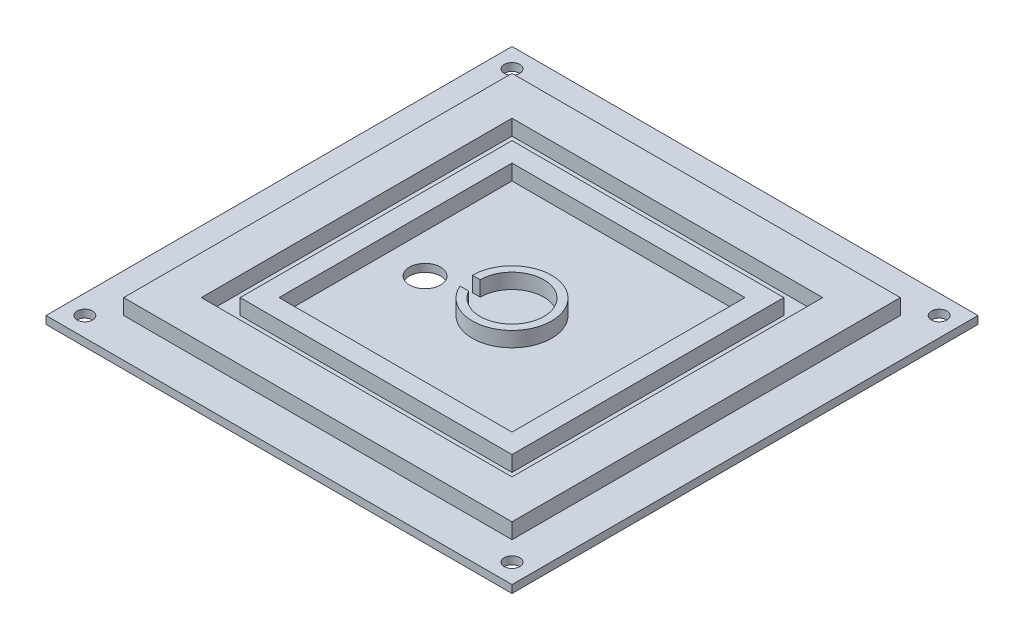
ISO-10303-21;
HEADER;
FILE_DESCRIPTION(('STEP AP214'),'2;1');
FILE_NAME('part.step','',(''),(''),'','','');
FILE_SCHEMA(('AUTOMOTIVE_DESIGN { 1 0 10303 214 1 1 1 1 }'));
ENDSEC;
DATA;
#1=APPLICATION_CONTEXT('core data for automotive mechanical design processes');
#2=APPLICATION_PROTOCOL_DEFINITION('international standard','automotive_design',2000,#1);
#3=PRODUCT_CONTEXT('',#1,'mechanical');
#4=PRODUCT('Part','Part','',(#3));
#5=PRODUCT_RELATED_PRODUCT_CATEGORY('part','',(#4));
#6=PRODUCT_DEFINITION_FORMATION('','',#4);
#7=PRODUCT_DEFINITION_CONTEXT('part definition',#1,'design');
#8=PRODUCT_DEFINITION('design','',#6,#7);
#9=PRODUCT_DEFINITION_SHAPE('','',#8);
#10=(LENGTH_UNIT() NAMED_UNIT(*) SI_UNIT(.MILLI.,.METRE.));
#11=(NAMED_UNIT(*) PLANE_ANGLE_UNIT() SI_UNIT($,.RADIAN.));
#12=(NAMED_UNIT(*) SI_UNIT($,.STERADIAN.) SOLID_ANGLE_UNIT());
#13=UNCERTAINTY_MEASURE_WITH_UNIT(LENGTH_MEASURE(1.E-05),#10,'distance_accuracy_value','');
#14=(GEOMETRIC_REPRESENTATION_CONTEXT(3) GLOBAL_UNCERTAINTY_ASSIGNED_CONTEXT((#13)) GLOBAL_UNIT_ASSIGNED_CONTEXT((#10,
#11,#12)) REPRESENTATION_CONTEXT('',''));
#15=CARTESIAN_POINT('',(0.,0.,0.));
#16=DIRECTION('',(0.,0.,1.));
#17=DIRECTION('',(1.,0.,0.));
#18=AXIS2_PLACEMENT_3D('',#15,#16,#17);
#19=CARTESIAN_POINT('',(0.,0.,0.));
#20=DIRECTION('',(0.,1.,0.));
#21=DIRECTION('',(0.,0.,1.));
#22=AXIS2_PLACEMENT_3D('',#19,#20,#21);
#23=PLANE('',#22);
#24=CARTESIAN_POINT('',(-25.4,0.,3.048));
#25=DIRECTION('',(0.,1.,0.));
#26=DIRECTION('',(0.,0.,1.));
#27=AXIS2_PLACEMENT_3D('',#24,#25,#26);
#28=CIRCLE('',#27,5.08);
#29=CARTESIAN_POINT('',(-25.4,0.,8.128));
#30=VERTEX_POINT('',#29);
#31=EDGE_CURVE('E247',#30,#30,#28,.T.);
#32=ORIENTED_EDGE('',*,*,#31,.F.);
#33=EDGE_LOOP('',(#32));
#34=FACE_BOUND('',#33,.T.);
#35=DIRECTION('',(0.,0.,-1.));
#36=VECTOR('',#35,1.);
#37=CARTESIAN_POINT('',(38.1,0.,-38.1));
#38=LINE('',#37,#36);
#39=CARTESIAN_POINT('',(38.1,0.,38.1));
#40=VERTEX_POINT('',#39);
#41=CARTESIAN_POINT('',(38.1,0.,-38.1));
#42=VERTEX_POINT('',#41);
#43=EDGE_CURVE('E266',#40,#42,#38,.T.);
#44=ORIENTED_EDGE('',*,*,#43,.T.);
#45=DIRECTION('',(-1.,0.,0.));
#46=VECTOR('',#45,1.);
#47=CARTESIAN_POINT('',(-38.1,0.,-38.1));
#48=LINE('',#47,#46);
#49=CARTESIAN_POINT('',(-38.1,0.,-38.1));
#50=VERTEX_POINT('',#49);
#51=EDGE_CURVE('E269',#42,#50,#48,.T.);
#52=ORIENTED_EDGE('',*,*,#51,.T.);
#53=DIRECTION('',(0.,0.,1.));
#54=VECTOR('',#53,1.);
#55=CARTESIAN_POINT('',(-38.1,0.,-38.1));
#56=LINE('',#55,#54);
#57=CARTESIAN_POINT('',(-38.1,0.,38.1));
#58=VERTEX_POINT('',#57);
#59=EDGE_CURVE('E273',#50,#58,#56,.T.);
#60=ORIENTED_EDGE('',*,*,#59,.T.);
#61=DIRECTION('',(1.,0.,0.));
#62=VECTOR('',#61,1.);
#63=CARTESIAN_POINT('',(-38.1,0.,38.1));
#64=LINE('',#63,#62);
#65=EDGE_CURVE('E276',#58,#40,#64,.T.);
#66=ORIENTED_EDGE('',*,*,#65,.T.);
#67=EDGE_LOOP('',(#44,#52,#60,#66));
#68=FACE_BOUND('',#67,.T.);
#69=DIRECTION('',(1.,0.,0.));
#70=VECTOR('',#69,1.);
#71=CARTESIAN_POINT('',(-10.414,0.,0.));
#72=LINE('',#71,#70);
#73=CARTESIAN_POINT('',(-12.954,0.,0.));
#74=VERTEX_POINT('',#73);
#75=CARTESIAN_POINT('',(-10.414,0.,0.));
#76=VERTEX_POINT('',#75);
#77=EDGE_CURVE('E256',#74,#76,#72,.T.);
#78=ORIENTED_EDGE('',*,*,#77,.F.);
#79=CARTESIAN_POINT('',(0.,0.,0.));
#80=DIRECTION('',(0.,1.,0.));
#81=DIRECTION('',(0.,0.,1.));
#82=AXIS2_PLACEMENT_3D('',#79,#80,#81);
#83=CIRCLE('',#82,12.954);
#84=CARTESIAN_POINT('',(-11.9163633714317,0.,5.07999999999999));
#85=VERTEX_POINT('',#84);
#86=EDGE_CURVE('E204',#85,#74,#83,.T.);
#87=ORIENTED_EDGE('',*,*,#86,.F.);
#88=DIRECTION('',(-1.,0.,0.));
#89=VECTOR('',#88,1.);
#90=CARTESIAN_POINT('',(-9.09092932543203,0.,5.07999999999999));
#91=LINE('',#90,#89);
#92=CARTESIAN_POINT('',(-9.09092932543203,0.,5.07999999999999));
#93=VERTEX_POINT('',#92);
#94=EDGE_CURVE('E260',#93,#85,#91,.T.);
#95=ORIENTED_EDGE('',*,*,#94,.F.);
#96=CARTESIAN_POINT('',(0.,0.,0.));
#97=DIRECTION('',(0.,-1.,0.));
#98=DIRECTION('',(0.,0.,1.));
#99=AXIS2_PLACEMENT_3D('',#96,#97,#98);
#100=CIRCLE('',#99,10.414);
#101=EDGE_CURVE('E258',#76,#93,#100,.T.);
#102=ORIENTED_EDGE('',*,*,#101,.F.);
#103=EDGE_LOOP('',(#78,#87,#95,#102));
#104=FACE_BOUND('',#103,.T.);
#105=ADVANCED_FACE('F35',(#34,#68,#104),#23,.T.);
#106=CARTESIAN_POINT('',(0.,0.,0.));
#107=DIRECTION('',(0.,1.,0.));
#108=DIRECTION('',(0.,0.,1.));
#109=AXIS2_PLACEMENT_3D('',#106,#107,#108);
#110=PLANE('',#109);
#111=DIRECTION('',(0.,0.,-1.));
#112=VECTOR('',#111,1.);
#113=CARTESIAN_POINT('',(50.8,0.,-50.8));
#114=LINE('',#113,#112);
#115=CARTESIAN_POINT('',(50.8,0.,50.8));
#116=VERTEX_POINT('',#115);
#117=CARTESIAN_POINT('',(50.8,0.,-50.8));
#118=VERTEX_POINT('',#117);
#119=EDGE_CURVE('E326',#116,#118,#114,.T.);
#120=ORIENTED_EDGE('',*,*,#119,.T.);
#121=DIRECTION('',(-1.,0.,0.));
#122=VECTOR('',#121,1.);
#123=CARTESIAN_POINT('',(-50.8,0.,-50.8));
#124=LINE('',#123,#122);
#125=CARTESIAN_POINT('',(-50.8,0.,-50.8));
#126=VERTEX_POINT('',#125);
#127=EDGE_CURVE('E329',#118,#126,#124,.T.);
#128=ORIENTED_EDGE('',*,*,#127,.T.);
#129=DIRECTION('',(0.,0.,1.));
#130=VECTOR('',#129,1.);
#131=CARTESIAN_POINT('',(-50.8,0.,-50.8));
#132=LINE('',#131,#130);
#133=CARTESIAN_POINT('',(-50.8,0.,50.8));
#134=VERTEX_POINT('',#133);
#135=EDGE_CURVE('E333',#126,#134,#132,.T.);
#136=ORIENTED_EDGE('',*,*,#135,.T.);
#137=DIRECTION('',(1.,0.,0.));
#138=VECTOR('',#137,1.);
#139=CARTESIAN_POINT('',(-50.8,0.,50.8));
#140=LINE('',#139,#138);
#141=EDGE_CURVE('E336',#134,#116,#140,.T.);
#142=ORIENTED_EDGE('',*,*,#141,.T.);
#143=EDGE_LOOP('',(#120,#128,#136,#142));
#144=FACE_BOUND('',#143,.T.);
#145=DIRECTION('',(-1.,0.,0.));
#146=VECTOR('',#145,1.);
#147=CARTESIAN_POINT('',(-44.45,0.,-44.45));
#148=LINE('',#147,#146);
#149=CARTESIAN_POINT('',(44.45,0.,-44.45));
#150=VERTEX_POINT('',#149);
#151=CARTESIAN_POINT('',(-44.45,0.,-44.45));
#152=VERTEX_POINT('',#151);
#153=EDGE_CURVE('E310',#150,#152,#148,.T.);
#154=ORIENTED_EDGE('',*,*,#153,.F.);
#155=DIRECTION('',(0.,0.,-1.));
#156=VECTOR('',#155,1.);
#157=CARTESIAN_POINT('',(44.45,0.,-44.45));
#158=LINE('',#157,#156);
#159=CARTESIAN_POINT('',(44.45,0.,44.45));
#160=VERTEX_POINT('',#159);
#161=EDGE_CURVE('E291',#160,#150,#158,.T.);
#162=ORIENTED_EDGE('',*,*,#161,.F.);
#163=DIRECTION('',(1.,0.,0.));
#164=VECTOR('',#163,1.);
#165=CARTESIAN_POINT('',(-44.45,0.,44.45));
#166=LINE('',#165,#164);
#167=CARTESIAN_POINT('',(-44.45,0.,44.45));
#168=VERTEX_POINT('',#167);
#169=EDGE_CURVE('E301',#168,#160,#166,.T.);
#170=ORIENTED_EDGE('',*,*,#169,.F.);
#171=DIRECTION('',(0.,0.,1.));
#172=VECTOR('',#171,1.);
#173=CARTESIAN_POINT('',(-44.45,0.,-44.45));
#174=LINE('',#173,#172);
#175=EDGE_CURVE('E312',#152,#168,#174,.T.);
#176=ORIENTED_EDGE('',*,*,#175,.F.);
#177=EDGE_LOOP('',(#154,#162,#170,#176));
#178=FACE_BOUND('',#177,.T.);
#179=ADVANCED_FACE('F439',(#144,#178),#110,.T.);
#180=CARTESIAN_POINT('',(76.2,-2.54,-76.2));
#181=DIRECTION('',(1.,0.,0.));
#182=DIRECTION('',(0.,0.,-1.));
#183=AXIS2_PLACEMENT_3D('',#180,#181,#182);
#184=PLANE('',#183);
#185=DIRECTION('',(0.,0.,-1.));
#186=VECTOR('',#185,1.);
#187=CARTESIAN_POINT('',(76.2,0.,-76.2));
#188=LINE('',#187,#186);
#189=CARTESIAN_POINT('',(76.2,0.,76.2));
#190=VERTEX_POINT('',#189);
#191=CARTESIAN_POINT('',(76.2,0.,-76.2));
#192=VERTEX_POINT('',#191);
#193=EDGE_CURVE('E387',#190,#192,#188,.T.);
#194=ORIENTED_EDGE('',*,*,#193,.F.);
#195=DIRECTION('',(0.,1.,0.));
#196=VECTOR('',#195,1.);
#197=CARTESIAN_POINT('',(76.2,-2.54,76.2));
#198=LINE('',#197,#196);
#199=CARTESIAN_POINT('',(76.2,-2.54,76.2));
#200=VERTEX_POINT('',#199);
#201=EDGE_CURVE('E11',#200,#190,#198,.T.);
#202=ORIENTED_EDGE('',*,*,#201,.F.);
#203=DIRECTION('',(0.,0.,-1.));
#204=VECTOR('',#203,1.);
#205=CARTESIAN_POINT('',(76.2,-2.54,-76.2));
#206=LINE('',#205,#204);
#207=CARTESIAN_POINT('',(76.2,-2.54,-76.2));
#208=VERTEX_POINT('',#207);
#209=EDGE_CURVE('E388',#200,#208,#206,.T.);
#210=ORIENTED_EDGE('',*,*,#209,.T.);
#211=DIRECTION('',(0.,1.,0.));
#212=VECTOR('',#211,1.);
#213=CARTESIAN_POINT('',(76.2,-2.54,-76.2));
#214=LINE('',#213,#212);
#215=EDGE_CURVE('E39',#208,#192,#214,.T.);
#216=ORIENTED_EDGE('',*,*,#215,.T.);
#217=EDGE_LOOP('',(#194,#202,#210,#216));
#218=FACE_BOUND('',#217,.T.);
#219=ADVANCED_FACE('F37',(#218),#184,.T.);
#220=CARTESIAN_POINT('',(-76.2,-2.54,76.2));
#221=DIRECTION('',(0.,0.,1.));
#222=DIRECTION('',(1.,0.,0.));
#223=AXIS2_PLACEMENT_3D('',#220,#221,#222);
#224=PLANE('',#223);
#225=DIRECTION('',(1.,0.,0.));
#226=VECTOR('',#225,1.);
#227=CARTESIAN_POINT('',(-76.2,0.,76.2));
#228=LINE('',#227,#226);
#229=CARTESIAN_POINT('',(-76.2,0.,76.2));
#230=VERTEX_POINT('',#229);
#231=EDGE_CURVE('E392',#230,#190,#228,.T.);
#232=ORIENTED_EDGE('',*,*,#231,.F.);
#233=DIRECTION('',(0.,1.,0.));
#234=VECTOR('',#233,1.);
#235=CARTESIAN_POINT('',(-76.2,-2.54,76.2));
#236=LINE('',#235,#234);
#237=CARTESIAN_POINT('',(-76.2,-2.54,76.2));
#238=VERTEX_POINT('',#237);
#239=EDGE_CURVE('E44',#238,#230,#236,.T.);
#240=ORIENTED_EDGE('',*,*,#239,.F.);
#241=DIRECTION('',(1.,0.,0.));
#242=VECTOR('',#241,1.);
#243=CARTESIAN_POINT('',(-76.2,-2.54,76.2));
#244=LINE('',#243,#242);
#245=EDGE_CURVE('E398',#238,#200,#244,.T.);
#246=ORIENTED_EDGE('',*,*,#245,.T.);
#247=ORIENTED_EDGE('',*,*,#201,.T.);
#248=EDGE_LOOP('',(#232,#240,#246,#247));
#249=FACE_BOUND('',#248,.T.);
#250=ADVANCED_FACE('F424',(#249),#224,.T.);
#251=CARTESIAN_POINT('',(-76.2,-2.54,-76.2));
#252=DIRECTION('',(-1.,0.,0.));
#253=DIRECTION('',(0.,0.,1.));
#254=AXIS2_PLACEMENT_3D('',#251,#252,#253);
#255=PLANE('',#254);
#256=DIRECTION('',(0.,0.,1.));
#257=VECTOR('',#256,1.);
#258=CARTESIAN_POINT('',(-76.2,0.,-76.2));
#259=LINE('',#258,#257);
#260=CARTESIAN_POINT('',(-76.2,0.,-76.2));
#261=VERTEX_POINT('',#260);
#262=EDGE_CURVE('E406',#261,#230,#259,.T.);
#263=ORIENTED_EDGE('',*,*,#262,.F.);
#264=DIRECTION('',(0.,1.,0.));
#265=VECTOR('',#264,1.);
#266=CARTESIAN_POINT('',(-76.2,-2.54,-76.2));
#267=LINE('',#266,#265);
#268=CARTESIAN_POINT('',(-76.2,-2.54,-76.2));
#269=VERTEX_POINT('',#268);
#270=EDGE_CURVE('E411',#269,#261,#267,.T.);
#271=ORIENTED_EDGE('',*,*,#270,.F.);
#272=DIRECTION('',(0.,0.,1.));
#273=VECTOR('',#272,1.);
#274=CARTESIAN_POINT('',(-76.2,-2.54,-76.2));
#275=LINE('',#274,#273);
#276=EDGE_CURVE('E395',#269,#238,#275,.T.);
#277=ORIENTED_EDGE('',*,*,#276,.T.);
#278=ORIENTED_EDGE('',*,*,#239,.T.);
#279=EDGE_LOOP('',(#263,#271,#277,#278));
#280=FACE_BOUND('',#279,.T.);
#281=ADVANCED_FACE('F430',(#280),#255,.T.);
#282=CARTESIAN_POINT('',(-76.2,-2.54,-76.2));
#283=DIRECTION('',(0.,0.,-1.));
#284=DIRECTION('',(-1.,0.,0.));
#285=AXIS2_PLACEMENT_3D('',#282,#283,#284);
#286=PLANE('',#285);
#287=DIRECTION('',(-1.,0.,0.));
#288=VECTOR('',#287,1.);
#289=CARTESIAN_POINT('',(-76.2,0.,-76.2));
#290=LINE('',#289,#288);
#291=EDGE_CURVE('E403',#192,#261,#290,.T.);
#292=ORIENTED_EDGE('',*,*,#291,.F.);
#293=ORIENTED_EDGE('',*,*,#215,.F.);
#294=DIRECTION('',(-1.,0.,0.));
#295=VECTOR('',#294,1.);
#296=CARTESIAN_POINT('',(-76.2,-2.54,-76.2));
#297=LINE('',#296,#295);
#298=EDGE_CURVE('E391',#208,#269,#297,.T.);
#299=ORIENTED_EDGE('',*,*,#298,.T.);
#300=ORIENTED_EDGE('',*,*,#270,.T.);
#301=EDGE_LOOP('',(#292,#293,#299,#300));
#302=FACE_BOUND('',#301,.T.);
#303=ADVANCED_FACE('F419',(#302),#286,.T.);
#304=CARTESIAN_POINT('',(0.,-2.54,0.));
#305=DIRECTION('',(0.,1.,0.));
#306=DIRECTION('',(0.,0.,1.));
#307=AXIS2_PLACEMENT_3D('',#304,#305,#306);
#308=PLANE('',#307);
#309=CARTESIAN_POINT('',(-69.85,-2.54,-69.85));
#310=DIRECTION('',(0.,1.,0.));
#311=DIRECTION('',(0.,0.,1.));
#312=AXIS2_PLACEMENT_3D('',#309,#310,#311);
#313=CIRCLE('',#312,2.53999999999999);
#314=CARTESIAN_POINT('',(-69.85,-2.54,-67.31));
#315=VERTEX_POINT('',#314);
#316=EDGE_CURVE('E239',#315,#315,#313,.T.);
#317=ORIENTED_EDGE('',*,*,#316,.T.);
#318=EDGE_LOOP('',(#317));
#319=FACE_BOUND('',#318,.T.);
#320=CARTESIAN_POINT('',(69.85,-2.54,-69.85));
#321=DIRECTION('',(0.,1.,0.));
#322=DIRECTION('',(0.,0.,1.));
#323=AXIS2_PLACEMENT_3D('',#320,#321,#322);
#324=CIRCLE('',#323,2.53999999999999);
#325=CARTESIAN_POINT('',(69.85,-2.54,-67.31));
#326=VERTEX_POINT('',#325);
#327=EDGE_CURVE('E233',#326,#326,#324,.T.);
#328=ORIENTED_EDGE('',*,*,#327,.T.);
#329=EDGE_LOOP('',(#328));
#330=FACE_BOUND('',#329,.T.);
#331=CARTESIAN_POINT('',(69.85,-2.54,69.85));
#332=DIRECTION('',(0.,1.,0.));
#333=DIRECTION('',(0.,0.,1.));
#334=AXIS2_PLACEMENT_3D('',#331,#332,#333);
#335=CIRCLE('',#334,2.53999999999999);
#336=CARTESIAN_POINT('',(69.85,-2.54,72.39));
#337=VERTEX_POINT('',#336);
#338=EDGE_CURVE('E226',#337,#337,#335,.T.);
#339=ORIENTED_EDGE('',*,*,#338,.T.);
#340=EDGE_LOOP('',(#339));
#341=FACE_BOUND('',#340,.T.);
#342=CARTESIAN_POINT('',(-69.85,-2.54,69.85));
#343=DIRECTION('',(0.,1.,0.));
#344=DIRECTION('',(0.,0.,1.));
#345=AXIS2_PLACEMENT_3D('',#342,#343,#344);
#346=CIRCLE('',#345,2.53999999999999);
#347=CARTESIAN_POINT('',(-69.85,-2.54,72.39));
#348=VERTEX_POINT('',#347);
#349=EDGE_CURVE('E244',#348,#348,#346,.T.);
#350=ORIENTED_EDGE('',*,*,#349,.T.);
#351=EDGE_LOOP('',(#350));
#352=FACE_BOUND('',#351,.T.);
#353=CARTESIAN_POINT('',(-25.4,-2.54,3.048));
#354=DIRECTION('',(0.,1.,0.));
#355=DIRECTION('',(0.,0.,1.));
#356=AXIS2_PLACEMENT_3D('',#353,#354,#355);
#357=CIRCLE('',#356,5.08);
#358=CARTESIAN_POINT('',(-25.4,-2.54,8.128));
#359=VERTEX_POINT('',#358);
#360=EDGE_CURVE('E250',#359,#359,#357,.T.);
#361=ORIENTED_EDGE('',*,*,#360,.T.);
#362=EDGE_LOOP('',(#361));
#363=FACE_BOUND('',#362,.T.);
#364=ORIENTED_EDGE('',*,*,#209,.F.);
#365=ORIENTED_EDGE('',*,*,#245,.F.);
#366=ORIENTED_EDGE('',*,*,#276,.F.);
#367=ORIENTED_EDGE('',*,*,#298,.F.);
#368=EDGE_LOOP('',(#364,#365,#366,#367));
#369=FACE_BOUND('',#368,.T.);
#370=ADVANCED_FACE('F427',(#319,#330,#341,#352,#363,#369),#308,.F.);
#371=CARTESIAN_POINT('',(0.,0.,0.));
#372=DIRECTION('',(0.,1.,0.));
#373=DIRECTION('',(0.,0.,1.));
#374=AXIS2_PLACEMENT_3D('',#371,#372,#373);
#375=PLANE('',#374);
#376=CARTESIAN_POINT('',(-69.85,0.,-69.85));
#377=DIRECTION('',(0.,1.,0.));
#378=DIRECTION('',(0.,0.,1.));
#379=AXIS2_PLACEMENT_3D('',#376,#377,#378);
#380=CIRCLE('',#379,2.53999999999999);
#381=CARTESIAN_POINT('',(-69.85,0.,-67.31));
#382=VERTEX_POINT('',#381);
#383=EDGE_CURVE('E225',#382,#382,#380,.T.);
#384=ORIENTED_EDGE('',*,*,#383,.F.);
#385=EDGE_LOOP('',(#384));
#386=FACE_BOUND('',#385,.T.);
#387=CARTESIAN_POINT('',(69.85,0.,-69.85));
#388=DIRECTION('',(0.,1.,0.));
#389=DIRECTION('',(0.,0.,1.));
#390=AXIS2_PLACEMENT_3D('',#387,#388,#389);
#391=CIRCLE('',#390,2.53999999999999);
#392=CARTESIAN_POINT('',(69.85,0.,-67.31));
#393=VERTEX_POINT('',#392);
#394=EDGE_CURVE('E236',#393,#393,#391,.T.);
#395=ORIENTED_EDGE('',*,*,#394,.F.);
#396=EDGE_LOOP('',(#395));
#397=FACE_BOUND('',#396,.T.);
#398=CARTESIAN_POINT('',(69.85,0.,69.85));
#399=DIRECTION('',(0.,1.,0.));
#400=DIRECTION('',(0.,0.,1.));
#401=AXIS2_PLACEMENT_3D('',#398,#399,#400);
#402=CIRCLE('',#401,2.53999999999999);
#403=CARTESIAN_POINT('',(69.85,0.,72.39));
#404=VERTEX_POINT('',#403);
#405=EDGE_CURVE('E230',#404,#404,#402,.T.);
#406=ORIENTED_EDGE('',*,*,#405,.F.);
#407=EDGE_LOOP('',(#406));
#408=FACE_BOUND('',#407,.T.);
#409=CARTESIAN_POINT('',(-69.85,0.,69.85));
#410=DIRECTION('',(0.,1.,0.));
#411=DIRECTION('',(0.,0.,1.));
#412=AXIS2_PLACEMENT_3D('',#409,#410,#411);
#413=CIRCLE('',#412,2.53999999999999);
#414=CARTESIAN_POINT('',(-69.85,0.,72.39));
#415=VERTEX_POINT('',#414);
#416=EDGE_CURVE('E229',#415,#415,#413,.T.);
#417=ORIENTED_EDGE('',*,*,#416,.F.);
#418=EDGE_LOOP('',(#417));
#419=FACE_BOUND('',#418,.T.);
#420=DIRECTION('',(-1.,0.,0.));
#421=VECTOR('',#420,1.);
#422=CARTESIAN_POINT('',(63.5,0.,-63.5));
#423=LINE('',#422,#421);
#424=CARTESIAN_POINT('',(63.5,0.,-63.5));
#425=VERTEX_POINT('',#424);
#426=CARTESIAN_POINT('',(-63.5,0.,-63.5));
#427=VERTEX_POINT('',#426);
#428=EDGE_CURVE('E351',#425,#427,#423,.T.);
#429=ORIENTED_EDGE('',*,*,#428,.F.);
#430=DIRECTION('',(0.,0.,-1.));
#431=VECTOR('',#430,1.);
#432=CARTESIAN_POINT('',(63.5,0.,63.5));
#433=LINE('',#432,#431);
#434=CARTESIAN_POINT('',(63.5,0.,63.5));
#435=VERTEX_POINT('',#434);
#436=EDGE_CURVE('E361',#435,#425,#433,.T.);
#437=ORIENTED_EDGE('',*,*,#436,.F.);
#438=DIRECTION('',(-1.,0.,0.));
#439=VECTOR('',#438,1.);
#440=CARTESIAN_POINT('',(63.5,0.,63.5));
#441=LINE('',#440,#439);
#442=CARTESIAN_POINT('',(-63.5,0.,63.5));
#443=VERTEX_POINT('',#442);
#444=EDGE_CURVE('E374',#435,#443,#441,.T.);
#445=ORIENTED_EDGE('',*,*,#444,.T.);
#446=DIRECTION('',(0.,0.,-1.));
#447=VECTOR('',#446,1.);
#448=CARTESIAN_POINT('',(-63.5,0.,63.5));
#449=LINE('',#448,#447);
#450=EDGE_CURVE('E371',#443,#427,#449,.T.);
#451=ORIENTED_EDGE('',*,*,#450,.T.);
#452=EDGE_LOOP('',(#429,#437,#445,#451));
#453=FACE_BOUND('',#452,.T.);
#454=ORIENTED_EDGE('',*,*,#193,.T.);
#455=ORIENTED_EDGE('',*,*,#291,.T.);
#456=ORIENTED_EDGE('',*,*,#262,.T.);
#457=ORIENTED_EDGE('',*,*,#231,.T.);
#458=EDGE_LOOP('',(#454,#455,#456,#457));
#459=FACE_BOUND('',#458,.T.);
#460=ADVANCED_FACE('F421',(#386,#397,#408,#419,#453,#459),#375,.T.);
#461=CARTESIAN_POINT('',(63.5,5.08,-63.5));
#462=DIRECTION('',(0.,0.,1.));
#463=DIRECTION('',(1.,0.,0.));
#464=AXIS2_PLACEMENT_3D('',#461,#462,#463);
#465=PLANE('',#464);
#466=ORIENTED_EDGE('',*,*,#428,.T.);
#467=DIRECTION('',(0.,-1.,0.));
#468=VECTOR('',#467,1.);
#469=CARTESIAN_POINT('',(-63.5,5.08,-63.5));
#470=LINE('',#469,#468);
#471=CARTESIAN_POINT('',(-63.5,5.08,-63.5));
#472=VERTEX_POINT('',#471);
#473=EDGE_CURVE('E384',#472,#427,#470,.T.);
#474=ORIENTED_EDGE('',*,*,#473,.F.);
#475=DIRECTION('',(-1.,0.,0.));
#476=VECTOR('',#475,1.);
#477=CARTESIAN_POINT('',(63.5,5.08,-63.5));
#478=LINE('',#477,#476);
#479=CARTESIAN_POINT('',(63.5,5.08,-63.5));
#480=VERTEX_POINT('',#479);
#481=EDGE_CURVE('E358',#480,#472,#478,.T.);
#482=ORIENTED_EDGE('',*,*,#481,.F.);
#483=DIRECTION('',(0.,-1.,0.));
#484=VECTOR('',#483,1.);
#485=CARTESIAN_POINT('',(63.5,5.08,-63.5));
#486=LINE('',#485,#484);
#487=EDGE_CURVE('E369',#480,#425,#486,.T.);
#488=ORIENTED_EDGE('',*,*,#487,.T.);
#489=EDGE_LOOP('',(#466,#474,#482,#488));
#490=FACE_BOUND('',#489,.T.);
#491=ADVANCED_FACE('F518',(#490),#465,.F.);
#492=CARTESIAN_POINT('',(-63.5,5.08,63.5));
#493=DIRECTION('',(-1.,0.,0.));
#494=DIRECTION('',(0.,0.,1.));
#495=AXIS2_PLACEMENT_3D('',#492,#493,#494);
#496=PLANE('',#495);
#497=ORIENTED_EDGE('',*,*,#450,.F.);
#498=DIRECTION('',(0.,-1.,0.));
#499=VECTOR('',#498,1.);
#500=CARTESIAN_POINT('',(-63.5,5.08,63.5));
#501=LINE('',#500,#499);
#502=CARTESIAN_POINT('',(-63.5,5.08,63.5));
#503=VERTEX_POINT('',#502);
#504=EDGE_CURVE('E382',#503,#443,#501,.T.);
#505=ORIENTED_EDGE('',*,*,#504,.F.);
#506=DIRECTION('',(0.,0.,-1.));
#507=VECTOR('',#506,1.);
#508=CARTESIAN_POINT('',(-63.5,5.08,63.5));
#509=LINE('',#508,#507);
#510=EDGE_CURVE('E360',#503,#472,#509,.T.);
#511=ORIENTED_EDGE('',*,*,#510,.T.);
#512=ORIENTED_EDGE('',*,*,#473,.T.);
#513=EDGE_LOOP('',(#497,#505,#511,#512));
#514=FACE_BOUND('',#513,.T.);
#515=ADVANCED_FACE('F514',(#514),#496,.T.);
#516=CARTESIAN_POINT('',(63.5,5.08,63.5));
#517=DIRECTION('',(0.,0.,1.));
#518=DIRECTION('',(1.,0.,0.));
#519=AXIS2_PLACEMENT_3D('',#516,#517,#518);
#520=PLANE('',#519);
#521=ORIENTED_EDGE('',*,*,#444,.F.);
#522=DIRECTION('',(0.,-1.,0.));
#523=VECTOR('',#522,1.);
#524=CARTESIAN_POINT('',(63.5,5.08,63.5));
#525=LINE('',#524,#523);
#526=CARTESIAN_POINT('',(63.5,5.08,63.5));
#527=VERTEX_POINT('',#526);
#528=EDGE_CURVE('E380',#527,#435,#525,.T.);
#529=ORIENTED_EDGE('',*,*,#528,.F.);
#530=DIRECTION('',(-1.,0.,0.));
#531=VECTOR('',#530,1.);
#532=CARTESIAN_POINT('',(63.5,5.08,63.5));
#533=LINE('',#532,#531);
#534=EDGE_CURVE('E364',#527,#503,#533,.T.);
#535=ORIENTED_EDGE('',*,*,#534,.T.);
#536=ORIENTED_EDGE('',*,*,#504,.T.);
#537=EDGE_LOOP('',(#521,#529,#535,#536));
#538=FACE_BOUND('',#537,.T.);
#539=ADVANCED_FACE('F510',(#538),#520,.T.);
#540=CARTESIAN_POINT('',(63.5,5.08,63.5));
#541=DIRECTION('',(-1.,0.,0.));
#542=DIRECTION('',(0.,0.,1.));
#543=AXIS2_PLACEMENT_3D('',#540,#541,#542);
#544=PLANE('',#543);
#545=ORIENTED_EDGE('',*,*,#436,.T.);
#546=ORIENTED_EDGE('',*,*,#487,.F.);
#547=DIRECTION('',(0.,0.,-1.));
#548=VECTOR('',#547,1.);
#549=CARTESIAN_POINT('',(63.5,5.08,63.5));
#550=LINE('',#549,#548);
#551=EDGE_CURVE('E367',#527,#480,#550,.T.);
#552=ORIENTED_EDGE('',*,*,#551,.F.);
#553=ORIENTED_EDGE('',*,*,#528,.T.);
#554=EDGE_LOOP('',(#545,#546,#552,#553));
#555=FACE_BOUND('',#554,.T.);
#556=ADVANCED_FACE('F506',(#555),#544,.F.);
#557=CARTESIAN_POINT('',(0.,5.08,0.));
#558=DIRECTION('',(0.,-1.,0.));
#559=DIRECTION('',(0.,0.,-1.));
#560=AXIS2_PLACEMENT_3D('',#557,#558,#559);
#561=PLANE('',#560);
#562=DIRECTION('',(-1.,0.,0.));
#563=VECTOR('',#562,1.);
#564=CARTESIAN_POINT('',(-50.8,5.08,-50.8));
#565=LINE('',#564,#563);
#566=CARTESIAN_POINT('',(50.8,5.08,-50.8));
#567=VERTEX_POINT('',#566);
#568=CARTESIAN_POINT('',(-50.8,5.08,-50.8));
#569=VERTEX_POINT('',#568);
#570=EDGE_CURVE('E341',#567,#569,#565,.T.);
#571=ORIENTED_EDGE('',*,*,#570,.F.);
#572=DIRECTION('',(0.,0.,-1.));
#573=VECTOR('',#572,1.);
#574=CARTESIAN_POINT('',(50.8,5.08,-50.8));
#575=LINE('',#574,#573);
#576=CARTESIAN_POINT('',(50.8,5.08,50.8));
#577=VERTEX_POINT('',#576);
#578=EDGE_CURVE('E325',#577,#567,#575,.T.);
#579=ORIENTED_EDGE('',*,*,#578,.F.);
#580=DIRECTION('',(1.,0.,0.));
#581=VECTOR('',#580,1.);
#582=CARTESIAN_POINT('',(-50.8,5.08,50.8));
#583=LINE('',#582,#581);
#584=CARTESIAN_POINT('',(-50.8,5.08,50.8));
#585=VERTEX_POINT('',#584);
#586=EDGE_CURVE('E330',#585,#577,#583,.T.);
#587=ORIENTED_EDGE('',*,*,#586,.F.);
#588=DIRECTION('',(0.,0.,1.));
#589=VECTOR('',#588,1.);
#590=CARTESIAN_POINT('',(-50.8,5.08,-50.8));
#591=LINE('',#590,#589);
#592=EDGE_CURVE('E344',#569,#585,#591,.T.);
#593=ORIENTED_EDGE('',*,*,#592,.F.);
#594=EDGE_LOOP('',(#571,#579,#587,#593));
#595=FACE_BOUND('',#594,.T.);
#596=ORIENTED_EDGE('',*,*,#481,.T.);
#597=ORIENTED_EDGE('',*,*,#510,.F.);
#598=ORIENTED_EDGE('',*,*,#534,.F.);
#599=ORIENTED_EDGE('',*,*,#551,.T.);
#600=EDGE_LOOP('',(#596,#597,#598,#599));
#601=FACE_BOUND('',#600,.T.);
#602=ADVANCED_FACE('F502',(#595,#601),#561,.F.);
#603=CARTESIAN_POINT('',(50.8,0.,-50.8));
#604=DIRECTION('',(1.,0.,0.));
#605=DIRECTION('',(0.,0.,-1.));
#606=AXIS2_PLACEMENT_3D('',#603,#604,#605);
#607=PLANE('',#606);
#608=ORIENTED_EDGE('',*,*,#578,.T.);
#609=DIRECTION('',(0.,1.,0.));
#610=VECTOR('',#609,1.);
#611=CARTESIAN_POINT('',(50.8,0.,-50.8));
#612=LINE('',#611,#610);
#613=EDGE_CURVE('E339',#118,#567,#612,.T.);
#614=ORIENTED_EDGE('',*,*,#613,.F.);
#615=ORIENTED_EDGE('',*,*,#119,.F.);
#616=DIRECTION('',(0.,1.,0.));
#617=VECTOR('',#616,1.);
#618=CARTESIAN_POINT('',(50.8,0.,50.8));
#619=LINE('',#618,#617);
#620=EDGE_CURVE('E349',#116,#577,#619,.T.);
#621=ORIENTED_EDGE('',*,*,#620,.T.);
#622=EDGE_LOOP('',(#608,#614,#615,#621));
#623=FACE_BOUND('',#622,.T.);
#624=ADVANCED_FACE('F492',(#623),#607,.F.);
#625=CARTESIAN_POINT('',(-50.8,0.,50.8));
#626=DIRECTION('',(0.,0.,1.));
#627=DIRECTION('',(1.,0.,0.));
#628=AXIS2_PLACEMENT_3D('',#625,#626,#627);
#629=PLANE('',#628);
#630=ORIENTED_EDGE('',*,*,#586,.T.);
#631=ORIENTED_EDGE('',*,*,#620,.F.);
#632=ORIENTED_EDGE('',*,*,#141,.F.);
#633=DIRECTION('',(0.,1.,0.));
#634=VECTOR('',#633,1.);
#635=CARTESIAN_POINT('',(-50.8,0.,50.8));
#636=LINE('',#635,#634);
#637=EDGE_CURVE('E352',#134,#585,#636,.T.);
#638=ORIENTED_EDGE('',*,*,#637,.T.);
#639=EDGE_LOOP('',(#630,#631,#632,#638));
#640=FACE_BOUND('',#639,.T.);
#641=ADVANCED_FACE('F488',(#640),#629,.F.);
#642=CARTESIAN_POINT('',(-50.8,0.,-50.8));
#643=DIRECTION('',(-1.,0.,0.));
#644=DIRECTION('',(0.,0.,1.));
#645=AXIS2_PLACEMENT_3D('',#642,#643,#644);
#646=PLANE('',#645);
#647=ORIENTED_EDGE('',*,*,#592,.T.);
#648=ORIENTED_EDGE('',*,*,#637,.F.);
#649=ORIENTED_EDGE('',*,*,#135,.F.);
#650=DIRECTION('',(0.,1.,0.));
#651=VECTOR('',#650,1.);
#652=CARTESIAN_POINT('',(-50.8,0.,-50.8));
#653=LINE('',#652,#651);
#654=EDGE_CURVE('E354',#126,#569,#653,.T.);
#655=ORIENTED_EDGE('',*,*,#654,.T.);
#656=EDGE_LOOP('',(#647,#648,#649,#655));
#657=FACE_BOUND('',#656,.T.);
#658=ADVANCED_FACE('F491',(#657),#646,.F.);
#659=CARTESIAN_POINT('',(-50.8,0.,-50.8));
#660=DIRECTION('',(0.,0.,-1.));
#661=DIRECTION('',(-1.,0.,0.));
#662=AXIS2_PLACEMENT_3D('',#659,#660,#661);
#663=PLANE('',#662);
#664=ORIENTED_EDGE('',*,*,#570,.T.);
#665=ORIENTED_EDGE('',*,*,#654,.F.);
#666=ORIENTED_EDGE('',*,*,#127,.F.);
#667=ORIENTED_EDGE('',*,*,#613,.T.);
#668=EDGE_LOOP('',(#664,#665,#666,#667));
#669=FACE_BOUND('',#668,.T.);
#670=ADVANCED_FACE('F485',(#669),#663,.F.);
#671=CARTESIAN_POINT('',(44.45,5.07999999999997,-44.45));
#672=DIRECTION('',(-1.,0.,0.));
#673=DIRECTION('',(0.,0.,1.));
#674=AXIS2_PLACEMENT_3D('',#671,#672,#673);
#675=PLANE('',#674);
#676=ORIENTED_EDGE('',*,*,#161,.T.);
#677=DIRECTION('',(0.,-1.,0.));
#678=VECTOR('',#677,1.);
#679=CARTESIAN_POINT('',(44.45,5.07999999999997,-44.45));
#680=LINE('',#679,#678);
#681=CARTESIAN_POINT('',(44.45,5.07999999999997,-44.45));
#682=VERTEX_POINT('',#681);
#683=EDGE_CURVE('E323',#682,#150,#680,.T.);
#684=ORIENTED_EDGE('',*,*,#683,.F.);
#685=DIRECTION('',(0.,0.,-1.));
#686=VECTOR('',#685,1.);
#687=CARTESIAN_POINT('',(44.45,5.07999999999997,-44.45));
#688=LINE('',#687,#686);
#689=CARTESIAN_POINT('',(44.45,5.07999999999997,44.45));
#690=VERTEX_POINT('',#689);
#691=EDGE_CURVE('E297',#690,#682,#688,.T.);
#692=ORIENTED_EDGE('',*,*,#691,.F.);
#693=DIRECTION('',(0.,-1.,0.));
#694=VECTOR('',#693,1.);
#695=CARTESIAN_POINT('',(44.45,5.07999999999997,44.45));
#696=LINE('',#695,#694);
#697=EDGE_CURVE('E307',#690,#160,#696,.T.);
#698=ORIENTED_EDGE('',*,*,#697,.T.);
#699=EDGE_LOOP('',(#676,#684,#692,#698));
#700=FACE_BOUND('',#699,.T.);
#701=ADVANCED_FACE('F482',(#700),#675,.F.);
#702=CARTESIAN_POINT('',(-44.45,5.07999999999997,-44.45));
#703=DIRECTION('',(0.,0.,1.));
#704=DIRECTION('',(1.,0.,0.));
#705=AXIS2_PLACEMENT_3D('',#702,#703,#704);
#706=PLANE('',#705);
#707=ORIENTED_EDGE('',*,*,#153,.T.);
#708=DIRECTION('',(0.,-1.,0.));
#709=VECTOR('',#708,1.);
#710=CARTESIAN_POINT('',(-44.45,5.07999999999997,-44.45));
#711=LINE('',#710,#709);
#712=CARTESIAN_POINT('',(-44.45,5.07999999999997,-44.45));
#713=VERTEX_POINT('',#712);
#714=EDGE_CURVE('E320',#713,#152,#711,.T.);
#715=ORIENTED_EDGE('',*,*,#714,.F.);
#716=DIRECTION('',(-1.,0.,0.));
#717=VECTOR('',#716,1.);
#718=CARTESIAN_POINT('',(-44.45,5.07999999999997,-44.45));
#719=LINE('',#718,#717);
#720=EDGE_CURVE('E300',#682,#713,#719,.T.);
#721=ORIENTED_EDGE('',*,*,#720,.F.);
#722=ORIENTED_EDGE('',*,*,#683,.T.);
#723=EDGE_LOOP('',(#707,#715,#721,#722));
#724=FACE_BOUND('',#723,.T.);
#725=ADVANCED_FACE('F478',(#724),#706,.F.);
#726=CARTESIAN_POINT('',(-44.45,5.07999999999997,-44.45));
#727=DIRECTION('',(1.,0.,0.));
#728=DIRECTION('',(0.,0.,-1.));
#729=AXIS2_PLACEMENT_3D('',#726,#727,#728);
#730=PLANE('',#729);
#731=ORIENTED_EDGE('',*,*,#175,.T.);
#732=DIRECTION('',(0.,-1.,0.));
#733=VECTOR('',#732,1.);
#734=CARTESIAN_POINT('',(-44.45,5.07999999999997,44.45));
#735=LINE('',#734,#733);
#736=CARTESIAN_POINT('',(-44.45,5.07999999999997,44.45));
#737=VERTEX_POINT('',#736);
#738=EDGE_CURVE('E318',#737,#168,#735,.T.);
#739=ORIENTED_EDGE('',*,*,#738,.F.);
#740=DIRECTION('',(0.,0.,1.));
#741=VECTOR('',#740,1.);
#742=CARTESIAN_POINT('',(-44.45,5.07999999999997,-44.45));
#743=LINE('',#742,#741);
#744=EDGE_CURVE('E303',#713,#737,#743,.T.);
#745=ORIENTED_EDGE('',*,*,#744,.F.);
#746=ORIENTED_EDGE('',*,*,#714,.T.);
#747=EDGE_LOOP('',(#731,#739,#745,#746));
#748=FACE_BOUND('',#747,.T.);
#749=ADVANCED_FACE('F474',(#748),#730,.F.);
#750=CARTESIAN_POINT('',(-44.45,5.07999999999997,44.45));
#751=DIRECTION('',(0.,0.,-1.));
#752=DIRECTION('',(-1.,0.,0.));
#753=AXIS2_PLACEMENT_3D('',#750,#751,#752);
#754=PLANE('',#753);
#755=ORIENTED_EDGE('',*,*,#169,.T.);
#756=ORIENTED_EDGE('',*,*,#697,.F.);
#757=DIRECTION('',(1.,0.,0.));
#758=VECTOR('',#757,1.);
#759=CARTESIAN_POINT('',(-44.45,5.07999999999997,44.45));
#760=LINE('',#759,#758);
#761=EDGE_CURVE('E305',#737,#690,#760,.T.);
#762=ORIENTED_EDGE('',*,*,#761,.F.);
#763=ORIENTED_EDGE('',*,*,#738,.T.);
#764=EDGE_LOOP('',(#755,#756,#762,#763));
#765=FACE_BOUND('',#764,.T.);
#766=ADVANCED_FACE('F470',(#765),#754,.F.);
#767=CARTESIAN_POINT('',(0.,5.07999999999997,0.));
#768=DIRECTION('',(0.,1.,0.));
#769=DIRECTION('',(0.,0.,1.));
#770=AXIS2_PLACEMENT_3D('',#767,#768,#769);
#771=PLANE('',#770);
#772=DIRECTION('',(0.,0.,-1.));
#773=VECTOR('',#772,1.);
#774=CARTESIAN_POINT('',(38.1,5.07999999999997,-38.1));
#775=LINE('',#774,#773);
#776=CARTESIAN_POINT('',(38.1,5.07999999999997,38.1));
#777=VERTEX_POINT('',#776);
#778=CARTESIAN_POINT('',(38.1,5.07999999999997,-38.1));
#779=VERTEX_POINT('',#778);
#780=EDGE_CURVE('E60',#777,#779,#775,.T.);
#781=ORIENTED_EDGE('',*,*,#780,.F.);
#782=DIRECTION('',(1.,0.,0.));
#783=VECTOR('',#782,1.);
#784=CARTESIAN_POINT('',(-38.1,5.07999999999997,38.1));
#785=LINE('',#784,#783);
#786=CARTESIAN_POINT('',(-38.1,5.07999999999997,38.1));
#787=VERTEX_POINT('',#786);
#788=EDGE_CURVE('E270',#787,#777,#785,.T.);
#789=ORIENTED_EDGE('',*,*,#788,.F.);
#790=DIRECTION('',(0.,0.,1.));
#791=VECTOR('',#790,1.);
#792=CARTESIAN_POINT('',(-38.1,5.07999999999997,-38.1));
#793=LINE('',#792,#791);
#794=CARTESIAN_POINT('',(-38.1,5.07999999999997,-38.1));
#795=VERTEX_POINT('',#794);
#796=EDGE_CURVE('E284',#795,#787,#793,.T.);
#797=ORIENTED_EDGE('',*,*,#796,.F.);
#798=DIRECTION('',(-1.,0.,0.));
#799=VECTOR('',#798,1.);
#800=CARTESIAN_POINT('',(-38.1,5.07999999999997,-38.1));
#801=LINE('',#800,#799);
#802=EDGE_CURVE('E281',#779,#795,#801,.T.);
#803=ORIENTED_EDGE('',*,*,#802,.F.);
#804=EDGE_LOOP('',(#781,#789,#797,#803));
#805=FACE_BOUND('',#804,.T.);
#806=ORIENTED_EDGE('',*,*,#691,.T.);
#807=ORIENTED_EDGE('',*,*,#720,.T.);
#808=ORIENTED_EDGE('',*,*,#744,.T.);
#809=ORIENTED_EDGE('',*,*,#761,.T.);
#810=EDGE_LOOP('',(#806,#807,#808,#809));
#811=FACE_BOUND('',#810,.T.);
#812=ADVANCED_FACE('F467',(#805,#811),#771,.T.);
#813=CARTESIAN_POINT('',(38.1,0.,-38.1));
#814=DIRECTION('',(1.,0.,0.));
#815=DIRECTION('',(0.,0.,-1.));
#816=AXIS2_PLACEMENT_3D('',#813,#814,#815);
#817=PLANE('',#816);
#818=ORIENTED_EDGE('',*,*,#780,.T.);
#819=DIRECTION('',(0.,1.,0.));
#820=VECTOR('',#819,1.);
#821=CARTESIAN_POINT('',(38.1,0.,-38.1));
#822=LINE('',#821,#820);
#823=EDGE_CURVE('E279',#42,#779,#822,.T.);
#824=ORIENTED_EDGE('',*,*,#823,.F.);
#825=ORIENTED_EDGE('',*,*,#43,.F.);
#826=DIRECTION('',(0.,1.,0.));
#827=VECTOR('',#826,1.);
#828=CARTESIAN_POINT('',(38.1,0.,38.1));
#829=LINE('',#828,#827);
#830=EDGE_CURVE('E289',#40,#777,#829,.T.);
#831=ORIENTED_EDGE('',*,*,#830,.T.);
#832=EDGE_LOOP('',(#818,#824,#825,#831));
#833=FACE_BOUND('',#832,.T.);
#834=ADVANCED_FACE('F456',(#833),#817,.F.);
#835=CARTESIAN_POINT('',(-38.1,0.,38.1));
#836=DIRECTION('',(0.,0.,1.));
#837=DIRECTION('',(1.,0.,0.));
#838=AXIS2_PLACEMENT_3D('',#835,#836,#837);
#839=PLANE('',#838);
#840=ORIENTED_EDGE('',*,*,#788,.T.);
#841=ORIENTED_EDGE('',*,*,#830,.F.);
#842=ORIENTED_EDGE('',*,*,#65,.F.);
#843=DIRECTION('',(0.,1.,0.));
#844=VECTOR('',#843,1.);
#845=CARTESIAN_POINT('',(-38.1,0.,38.1));
#846=LINE('',#845,#844);
#847=EDGE_CURVE('E292',#58,#787,#846,.T.);
#848=ORIENTED_EDGE('',*,*,#847,.T.);
#849=EDGE_LOOP('',(#840,#841,#842,#848));
#850=FACE_BOUND('',#849,.T.);
#851=ADVANCED_FACE('F452',(#850),#839,.F.);
#852=CARTESIAN_POINT('',(-38.1,0.,-38.1));
#853=DIRECTION('',(-1.,0.,0.));
#854=DIRECTION('',(0.,0.,1.));
#855=AXIS2_PLACEMENT_3D('',#852,#853,#854);
#856=PLANE('',#855);
#857=ORIENTED_EDGE('',*,*,#796,.T.);
#858=ORIENTED_EDGE('',*,*,#847,.F.);
#859=ORIENTED_EDGE('',*,*,#59,.F.);
#860=DIRECTION('',(0.,1.,0.));
#861=VECTOR('',#860,1.);
#862=CARTESIAN_POINT('',(-38.1,0.,-38.1));
#863=LINE('',#862,#861);
#864=EDGE_CURVE('E294',#50,#795,#863,.T.);
#865=ORIENTED_EDGE('',*,*,#864,.T.);
#866=EDGE_LOOP('',(#857,#858,#859,#865));
#867=FACE_BOUND('',#866,.T.);
#868=ADVANCED_FACE('F455',(#867),#856,.F.);
#869=CARTESIAN_POINT('',(-38.1,0.,-38.1));
#870=DIRECTION('',(0.,0.,-1.));
#871=DIRECTION('',(-1.,0.,0.));
#872=AXIS2_PLACEMENT_3D('',#869,#870,#871);
#873=PLANE('',#872);
#874=ORIENTED_EDGE('',*,*,#802,.T.);
#875=ORIENTED_EDGE('',*,*,#864,.F.);
#876=ORIENTED_EDGE('',*,*,#51,.F.);
#877=ORIENTED_EDGE('',*,*,#823,.T.);
#878=EDGE_LOOP('',(#874,#875,#876,#877));
#879=FACE_BOUND('',#878,.T.);
#880=ADVANCED_FACE('F460',(#879),#873,.F.);
#881=CARTESIAN_POINT('',(0.,2.794,0.));
#882=DIRECTION('',(0.,-1.,0.));
#883=DIRECTION('',(0.,0.,-1.));
#884=AXIS2_PLACEMENT_3D('',#881,#882,#883);
#885=CYLINDRICAL_SURFACE('',#884,12.954);
#886=ORIENTED_EDGE('',*,*,#86,.T.);
#887=DIRECTION('',(0.,-1.,0.));
#888=VECTOR('',#887,1.);
#889=CARTESIAN_POINT('',(-12.954,2.794,0.));
#890=LINE('',#889,#888);
#891=CARTESIAN_POINT('',(-12.954,4.9276,0.));
#892=VERTEX_POINT('',#891);
#893=EDGE_CURVE('E197',#892,#74,#890,.T.);
#894=ORIENTED_EDGE('',*,*,#893,.F.);
#895=CARTESIAN_POINT('',(0.,4.9276,0.));
#896=DIRECTION('',(0.,1.,0.));
#897=DIRECTION('',(0.,0.,1.));
#898=AXIS2_PLACEMENT_3D('',#895,#896,#897);
#899=CIRCLE('',#898,12.954);
#900=CARTESIAN_POINT('',(-11.9163633714317,4.9276,5.07999999999999));
#901=VERTEX_POINT('',#900);
#902=EDGE_CURVE('E202',#901,#892,#899,.T.);
#903=ORIENTED_EDGE('',*,*,#902,.F.);
#904=DIRECTION('',(0.,-1.,0.));
#905=VECTOR('',#904,1.);
#906=CARTESIAN_POINT('',(-11.9163633714317,2.794,5.07999999999999));
#907=LINE('',#906,#905);
#908=EDGE_CURVE('E262',#901,#85,#907,.T.);
#909=ORIENTED_EDGE('',*,*,#908,.T.);
#910=EDGE_LOOP('',(#886,#894,#903,#909));
#911=FACE_BOUND('',#910,.T.);
#912=ADVANCED_FACE('F199',(#911),#885,.T.);
#913=CARTESIAN_POINT('',(-10.414,2.794,0.));
#914=DIRECTION('',(0.,0.,-1.));
#915=DIRECTION('',(-1.,0.,0.));
#916=AXIS2_PLACEMENT_3D('',#913,#914,#915);
#917=PLANE('',#916);
#918=ORIENTED_EDGE('',*,*,#77,.T.);
#919=DIRECTION('',(0.,-1.,0.));
#920=VECTOR('',#919,1.);
#921=CARTESIAN_POINT('',(-10.414,2.794,0.));
#922=LINE('',#921,#920);
#923=CARTESIAN_POINT('',(-10.414,4.9276,0.));
#924=VERTEX_POINT('',#923);
#925=EDGE_CURVE('E207',#924,#76,#922,.T.);
#926=ORIENTED_EDGE('',*,*,#925,.F.);
#927=DIRECTION('',(1.,0.,0.));
#928=VECTOR('',#927,1.);
#929=CARTESIAN_POINT('',(-10.414,4.9276,0.));
#930=LINE('',#929,#928);
#931=EDGE_CURVE('E210',#892,#924,#930,.T.);
#932=ORIENTED_EDGE('',*,*,#931,.F.);
#933=ORIENTED_EDGE('',*,*,#893,.T.);
#934=EDGE_LOOP('',(#918,#926,#932,#933));
#935=FACE_BOUND('',#934,.T.);
#936=ADVANCED_FACE('F211',(#935),#917,.F.);
#937=CARTESIAN_POINT('',(0.,2.794,0.));
#938=DIRECTION('',(0.,-1.,0.));
#939=DIRECTION('',(0.,0.,-1.));
#940=AXIS2_PLACEMENT_3D('',#937,#938,#939);
#941=CYLINDRICAL_SURFACE('',#940,10.414);
#942=ORIENTED_EDGE('',*,*,#101,.T.);
#943=DIRECTION('',(0.,-1.,0.));
#944=VECTOR('',#943,1.);
#945=CARTESIAN_POINT('',(-9.09092932543203,2.794,5.07999999999999));
#946=LINE('',#945,#944);
#947=CARTESIAN_POINT('',(-9.09092932543203,4.9276,5.07999999999999));
#948=VERTEX_POINT('',#947);
#949=EDGE_CURVE('E52',#948,#93,#946,.T.);
#950=ORIENTED_EDGE('',*,*,#949,.F.);
#951=CARTESIAN_POINT('',(0.,4.9276,0.));
#952=DIRECTION('',(0.,-1.,0.));
#953=DIRECTION('',(0.,0.,1.));
#954=AXIS2_PLACEMENT_3D('',#951,#952,#953);
#955=CIRCLE('',#954,10.414);
#956=EDGE_CURVE('E216',#924,#948,#955,.T.);
#957=ORIENTED_EDGE('',*,*,#956,.F.);
#958=ORIENTED_EDGE('',*,*,#925,.T.);
#959=EDGE_LOOP('',(#942,#950,#957,#958));
#960=FACE_BOUND('',#959,.T.);
#961=ADVANCED_FACE('F573',(#960),#941,.F.);
#962=CARTESIAN_POINT('',(-9.09092932543203,2.794,5.07999999999999));
#963=DIRECTION('',(0.,0.,1.));
#964=DIRECTION('',(1.,0.,0.));
#965=AXIS2_PLACEMENT_3D('',#962,#963,#964);
#966=PLANE('',#965);
#967=ORIENTED_EDGE('',*,*,#94,.T.);
#968=ORIENTED_EDGE('',*,*,#908,.F.);
#969=DIRECTION('',(-1.,0.,0.));
#970=VECTOR('',#969,1.);
#971=CARTESIAN_POINT('',(-9.09092932543203,4.9276,5.07999999999999));
#972=LINE('',#971,#970);
#973=EDGE_CURVE('E220',#948,#901,#972,.T.);
#974=ORIENTED_EDGE('',*,*,#973,.F.);
#975=ORIENTED_EDGE('',*,*,#949,.T.);
#976=EDGE_LOOP('',(#967,#968,#974,#975));
#977=FACE_BOUND('',#976,.T.);
#978=ADVANCED_FACE('F563',(#977),#966,.F.);
#979=CARTESIAN_POINT('',(-25.4,-2.54,3.048));
#980=DIRECTION('',(0.,1.,0.));
#981=DIRECTION('',(0.,0.,1.));
#982=AXIS2_PLACEMENT_3D('',#979,#980,#981);
#983=CYLINDRICAL_SURFACE('',#982,5.08);
#984=ORIENTED_EDGE('',*,*,#360,.F.);
#985=EDGE_LOOP('',(#984));
#986=FACE_BOUND('',#985,.T.);
#987=ORIENTED_EDGE('',*,*,#31,.T.);
#988=EDGE_LOOP('',(#987));
#989=FACE_BOUND('',#988,.T.);
#990=ADVANCED_FACE('F553',(#986,#989),#983,.F.);
#991=CARTESIAN_POINT('',(-69.85,-2.54,69.85));
#992=DIRECTION('',(0.,1.,0.));
#993=DIRECTION('',(0.,0.,1.));
#994=AXIS2_PLACEMENT_3D('',#991,#992,#993);
#995=CYLINDRICAL_SURFACE('',#994,2.53999999999999);
#996=ORIENTED_EDGE('',*,*,#349,.F.);
#997=EDGE_LOOP('',(#996));
#998=FACE_BOUND('',#997,.T.);
#999=ORIENTED_EDGE('',*,*,#416,.T.);
#1000=EDGE_LOOP('',(#999));
#1001=FACE_BOUND('',#1000,.T.);
#1002=ADVANCED_FACE('F550',(#998,#1001),#995,.F.);
#1003=CARTESIAN_POINT('',(69.85,-2.54,69.85));
#1004=DIRECTION('',(0.,1.,0.));
#1005=DIRECTION('',(0.,0.,1.));
#1006=AXIS2_PLACEMENT_3D('',#1003,#1004,#1005);
#1007=CYLINDRICAL_SURFACE('',#1006,2.53999999999999);
#1008=ORIENTED_EDGE('',*,*,#338,.F.);
#1009=EDGE_LOOP('',(#1008));
#1010=FACE_BOUND('',#1009,.T.);
#1011=ORIENTED_EDGE('',*,*,#405,.T.);
#1012=EDGE_LOOP('',(#1011));
#1013=FACE_BOUND('',#1012,.T.);
#1014=ADVANCED_FACE('F552',(#1010,#1013),#1007,.F.);
#1015=CARTESIAN_POINT('',(69.85,-2.54,-69.85));
#1016=DIRECTION('',(0.,1.,0.));
#1017=DIRECTION('',(0.,0.,1.));
#1018=AXIS2_PLACEMENT_3D('',#1015,#1016,#1017);
#1019=CYLINDRICAL_SURFACE('',#1018,2.53999999999999);
#1020=ORIENTED_EDGE('',*,*,#327,.F.);
#1021=EDGE_LOOP('',(#1020));
#1022=FACE_BOUND('',#1021,.T.);
#1023=ORIENTED_EDGE('',*,*,#394,.T.);
#1024=EDGE_LOOP('',(#1023));
#1025=FACE_BOUND('',#1024,.T.);
#1026=ADVANCED_FACE('F560',(#1022,#1025),#1019,.F.);
#1027=CARTESIAN_POINT('',(-69.85,-2.54,-69.85));
#1028=DIRECTION('',(0.,1.,0.));
#1029=DIRECTION('',(0.,0.,1.));
#1030=AXIS2_PLACEMENT_3D('',#1027,#1028,#1029);
#1031=CYLINDRICAL_SURFACE('',#1030,2.53999999999999);
#1032=ORIENTED_EDGE('',*,*,#316,.F.);
#1033=EDGE_LOOP('',(#1032));
#1034=FACE_BOUND('',#1033,.T.);
#1035=ORIENTED_EDGE('',*,*,#383,.T.);
#1036=EDGE_LOOP('',(#1035));
#1037=FACE_BOUND('',#1036,.T.);
#1038=ADVANCED_FACE('F568',(#1034,#1037),#1031,.F.);
#1039=CARTESIAN_POINT('',(0.,4.9276,0.));
#1040=DIRECTION('',(0.,1.,0.));
#1041=DIRECTION('',(0.,0.,1.));
#1042=AXIS2_PLACEMENT_3D('',#1039,#1040,#1041);
#1043=PLANE('',#1042);
#1044=ORIENTED_EDGE('',*,*,#902,.T.);
#1045=ORIENTED_EDGE('',*,*,#931,.T.);
#1046=ORIENTED_EDGE('',*,*,#956,.T.);
#1047=ORIENTED_EDGE('',*,*,#973,.T.);
#1048=EDGE_LOOP('',(#1044,#1045,#1046,#1047));
#1049=FACE_BOUND('',#1048,.T.);
#1050=ADVANCED_FACE('F219',(#1049),#1043,.T.);
#1051=CLOSED_SHELL('',(#105,#179,#219,#250,#281,#303,#370,#460,#491,#515,#539,#556,#602,#624,
#641,#658,#670,#701,#725,#749,#766,#812,#834,#851,#868,#880,#912,#936,#961,#978,#990,#1002,
#1014,#1026,#1038,#1050));
#1052=MANIFOLD_SOLID_BREP('B2',#1051);
#1053=ADVANCED_BREP_SHAPE_REPRESENTATION('',(#18,#1052),#14);
#1054=SHAPE_DEFINITION_REPRESENTATION(#9,#1053);
ENDSEC;
END-ISO-10303-21;
